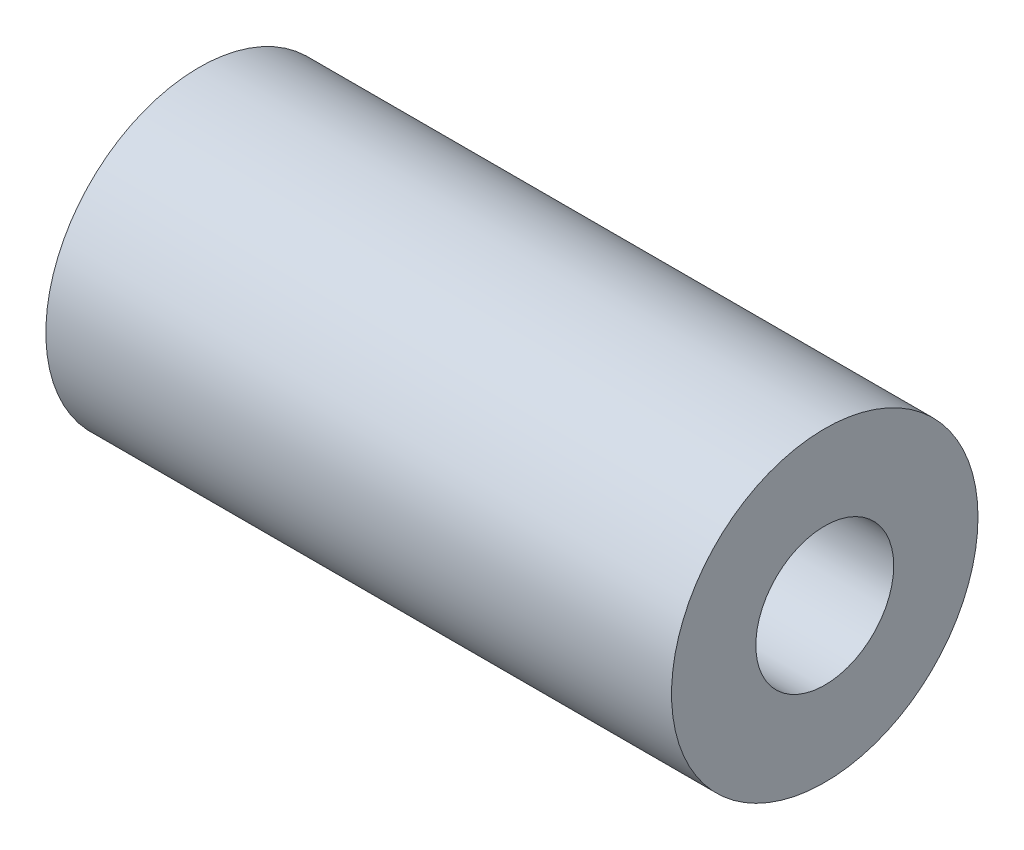
ISO-10303-21;
HEADER;
FILE_DESCRIPTION(('STEP AP214'),'2;1');
FILE_NAME('part.step','',(''),(''),'','','');
FILE_SCHEMA(('AUTOMOTIVE_DESIGN { 1 0 10303 214 1 1 1 1 }'));
ENDSEC;
DATA;
#1=APPLICATION_CONTEXT('core data for automotive mechanical design processes');
#2=APPLICATION_PROTOCOL_DEFINITION('international standard','automotive_design',2000,#1);
#3=PRODUCT_CONTEXT('',#1,'mechanical');
#4=PRODUCT('Part','Part','',(#3));
#5=PRODUCT_RELATED_PRODUCT_CATEGORY('part','',(#4));
#6=PRODUCT_DEFINITION_FORMATION('','',#4);
#7=PRODUCT_DEFINITION_CONTEXT('part definition',#1,'design');
#8=PRODUCT_DEFINITION('design','',#6,#7);
#9=PRODUCT_DEFINITION_SHAPE('','',#8);
#10=(LENGTH_UNIT() NAMED_UNIT(*) SI_UNIT(.MILLI.,.METRE.));
#11=(NAMED_UNIT(*) PLANE_ANGLE_UNIT() SI_UNIT($,.RADIAN.));
#12=(NAMED_UNIT(*) SI_UNIT($,.STERADIAN.) SOLID_ANGLE_UNIT());
#13=UNCERTAINTY_MEASURE_WITH_UNIT(LENGTH_MEASURE(1.E-05),#10,'distance_accuracy_value','');
#14=(GEOMETRIC_REPRESENTATION_CONTEXT(3) GLOBAL_UNCERTAINTY_ASSIGNED_CONTEXT((#13)) GLOBAL_UNIT_ASSIGNED_CONTEXT((#10,
#11,#12)) REPRESENTATION_CONTEXT('',''));
#15=CARTESIAN_POINT('',(0.,0.,0.));
#16=DIRECTION('',(0.,0.,1.));
#17=DIRECTION('',(1.,0.,0.));
#18=AXIS2_PLACEMENT_3D('',#15,#16,#17);
#19=CARTESIAN_POINT('',(24.5,0.,0.));
#20=DIRECTION('',(1.,0.,0.));
#21=DIRECTION('',(0.,0.,-1.));
#22=AXIS2_PLACEMENT_3D('',#19,#20,#21);
#23=PLANE('',#22);
#24=CARTESIAN_POINT('',(24.5,0.,0.));
#25=DIRECTION('',(1.,0.,0.));
#26=DIRECTION('',(0.,0.,-1.));
#27=AXIS2_PLACEMENT_3D('',#24,#25,#26);
#28=CIRCLE('',#27,6.);
#29=CARTESIAN_POINT('',(24.5,0.,-6.));
#30=VERTEX_POINT('',#29);
#31=EDGE_CURVE('E10',#30,#30,#28,.T.);
#32=ORIENTED_EDGE('',*,*,#31,.T.);
#33=EDGE_LOOP('',(#32));
#34=FACE_BOUND('',#33,.T.);
#35=CARTESIAN_POINT('',(24.5,0.,0.));
#36=DIRECTION('',(1.,0.,0.));
#37=DIRECTION('',(0.,0.,-1.));
#38=AXIS2_PLACEMENT_3D('',#35,#36,#37);
#39=CIRCLE('',#38,2.7);
#40=CARTESIAN_POINT('',(24.5,0.,-2.7));
#41=VERTEX_POINT('',#40);
#42=EDGE_CURVE('E44',#41,#41,#39,.T.);
#43=ORIENTED_EDGE('',*,*,#42,.F.);
#44=EDGE_LOOP('',(#43));
#45=FACE_BOUND('',#44,.T.);
#46=ADVANCED_FACE('F33',(#34,#45),#23,.T.);
#47=CARTESIAN_POINT('',(0.,0.,0.));
#48=DIRECTION('',(1.,0.,0.));
#49=DIRECTION('',(0.,0.,-1.));
#50=AXIS2_PLACEMENT_3D('',#47,#48,#49);
#51=PLANE('',#50);
#52=CARTESIAN_POINT('',(0.,0.,0.));
#53=DIRECTION('',(1.,0.,0.));
#54=DIRECTION('',(0.,0.,-1.));
#55=AXIS2_PLACEMENT_3D('',#52,#53,#54);
#56=CIRCLE('',#55,6.);
#57=CARTESIAN_POINT('',(0.,0.,-6.));
#58=VERTEX_POINT('',#57);
#59=EDGE_CURVE('E37',#58,#58,#56,.T.);
#60=ORIENTED_EDGE('',*,*,#59,.F.);
#61=EDGE_LOOP('',(#60));
#62=FACE_BOUND('',#61,.T.);
#63=CARTESIAN_POINT('',(0.,0.,0.));
#64=DIRECTION('',(1.,0.,0.));
#65=DIRECTION('',(0.,0.,-1.));
#66=AXIS2_PLACEMENT_3D('',#63,#64,#65);
#67=CIRCLE('',#66,2.7);
#68=CARTESIAN_POINT('',(0.,0.,-2.7));
#69=VERTEX_POINT('',#68);
#70=EDGE_CURVE('E46',#69,#69,#67,.T.);
#71=ORIENTED_EDGE('',*,*,#70,.T.);
#72=EDGE_LOOP('',(#71));
#73=FACE_BOUND('',#72,.T.);
#74=ADVANCED_FACE('F56',(#62,#73),#51,.F.);
#75=CARTESIAN_POINT('',(24.5,0.,0.));
#76=DIRECTION('',(-1.,0.,0.));
#77=DIRECTION('',(0.,0.,1.));
#78=AXIS2_PLACEMENT_3D('',#75,#76,#77);
#79=CYLINDRICAL_SURFACE('',#78,6.);
#80=ORIENTED_EDGE('',*,*,#31,.F.);
#81=EDGE_LOOP('',(#80));
#82=FACE_BOUND('',#81,.T.);
#83=ORIENTED_EDGE('',*,*,#59,.T.);
#84=EDGE_LOOP('',(#83));
#85=FACE_BOUND('',#84,.T.);
#86=ADVANCED_FACE('F35',(#82,#85),#79,.T.);
#87=CARTESIAN_POINT('',(24.5,0.,0.));
#88=DIRECTION('',(-1.,0.,0.));
#89=DIRECTION('',(0.,0.,1.));
#90=AXIS2_PLACEMENT_3D('',#87,#88,#89);
#91=CYLINDRICAL_SURFACE('',#90,2.7);
#92=ORIENTED_EDGE('',*,*,#42,.T.);
#93=EDGE_LOOP('',(#92));
#94=FACE_BOUND('',#93,.T.);
#95=ORIENTED_EDGE('',*,*,#70,.F.);
#96=EDGE_LOOP('',(#95));
#97=FACE_BOUND('',#96,.T.);
#98=ADVANCED_FACE('F52',(#94,#97),#91,.F.);
#99=CLOSED_SHELL('',(#46,#74,#86,#98));
#100=MANIFOLD_SOLID_BREP('B2',#99);
#101=ADVANCED_BREP_SHAPE_REPRESENTATION('',(#18,#100),#14);
#102=SHAPE_DEFINITION_REPRESENTATION(#9,#101);
ENDSEC;
END-ISO-10303-21;
